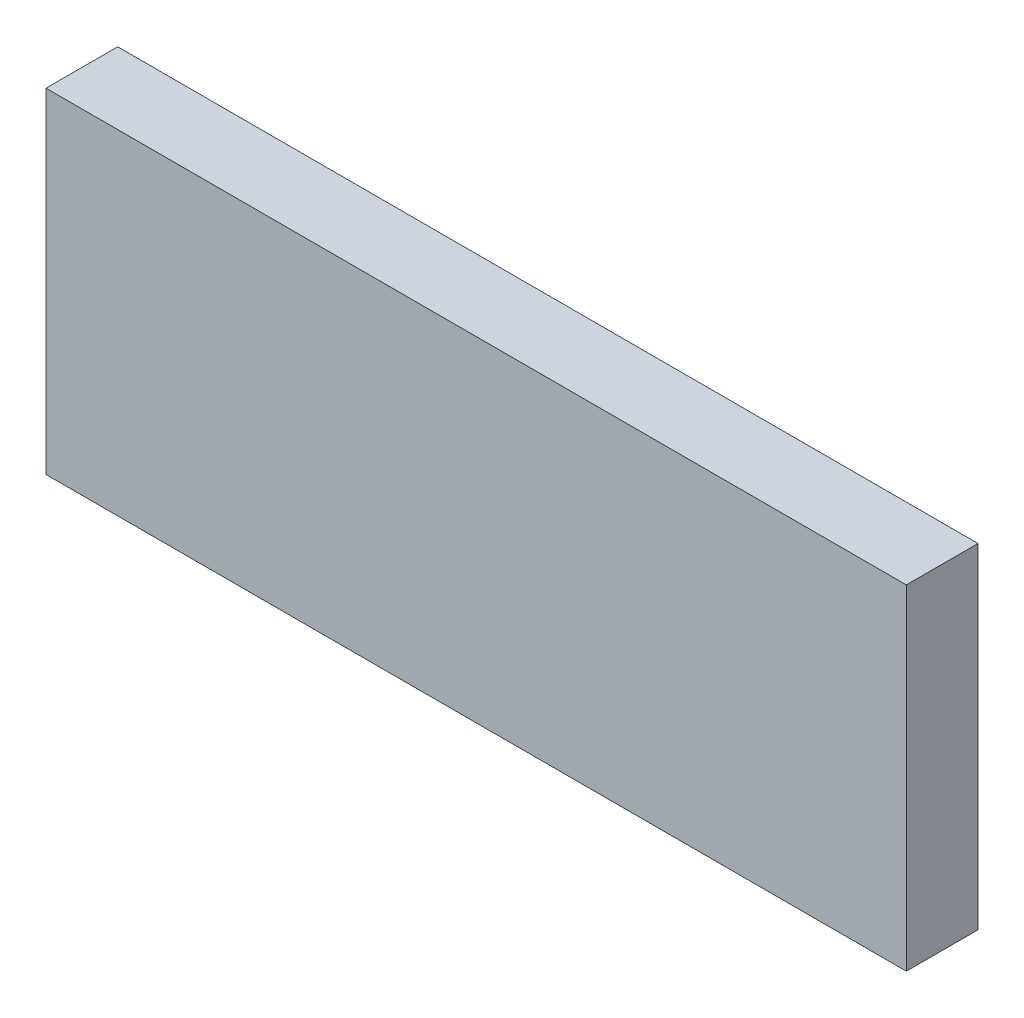
ISO-10303-21;
HEADER;
FILE_DESCRIPTION(('STEP AP214'),'2;1');
FILE_NAME('part.step','',(''),(''),'','','');
FILE_SCHEMA(('AUTOMOTIVE_DESIGN { 1 0 10303 214 1 1 1 1 }'));
ENDSEC;
DATA;
#1=APPLICATION_CONTEXT('core data for automotive mechanical design processes');
#2=APPLICATION_PROTOCOL_DEFINITION('international standard','automotive_design',2000,#1);
#3=PRODUCT_CONTEXT('',#1,'mechanical');
#4=PRODUCT('Part','Part','',(#3));
#5=PRODUCT_RELATED_PRODUCT_CATEGORY('part','',(#4));
#6=PRODUCT_DEFINITION_FORMATION('','',#4);
#7=PRODUCT_DEFINITION_CONTEXT('part definition',#1,'design');
#8=PRODUCT_DEFINITION('design','',#6,#7);
#9=PRODUCT_DEFINITION_SHAPE('','',#8);
#10=(LENGTH_UNIT() NAMED_UNIT(*) SI_UNIT(.MILLI.,.METRE.));
#11=(NAMED_UNIT(*) PLANE_ANGLE_UNIT() SI_UNIT($,.RADIAN.));
#12=(NAMED_UNIT(*) SI_UNIT($,.STERADIAN.) SOLID_ANGLE_UNIT());
#13=UNCERTAINTY_MEASURE_WITH_UNIT(LENGTH_MEASURE(1.E-05),#10,'distance_accuracy_value','');
#14=(GEOMETRIC_REPRESENTATION_CONTEXT(3) GLOBAL_UNCERTAINTY_ASSIGNED_CONTEXT((#13)) GLOBAL_UNIT_ASSIGNED_CONTEXT((#10,
#11,#12)) REPRESENTATION_CONTEXT('',''));
#15=CARTESIAN_POINT('',(0.,0.,0.));
#16=DIRECTION('',(0.,0.,1.));
#17=DIRECTION('',(1.,0.,0.));
#18=AXIS2_PLACEMENT_3D('',#15,#16,#17);
#19=CARTESIAN_POINT('',(0.,0.,0.15));
#20=DIRECTION('',(0.,0.,1.));
#21=DIRECTION('',(1.,0.,0.));
#22=AXIS2_PLACEMENT_3D('',#19,#20,#21);
#23=PLANE('',#22);
#24=DIRECTION('',(0.,1.,0.));
#25=VECTOR('',#24,1.);
#26=CARTESIAN_POINT('',(-1.95,1.15,0.15));
#27=LINE('',#26,#25);
#28=CARTESIAN_POINT('',(-1.95,1.15,0.15));
#29=VERTEX_POINT('',#28);
#30=CARTESIAN_POINT('',(-1.95,1.85,0.15));
#31=VERTEX_POINT('',#30);
#32=EDGE_CURVE('E54',#29,#31,#27,.T.);
#33=ORIENTED_EDGE('',*,*,#32,.T.);
#34=DIRECTION('',(1.,0.,0.));
#35=VECTOR('',#34,1.);
#36=CARTESIAN_POINT('',(-1.95,1.85,0.15));
#37=LINE('',#36,#35);
#38=CARTESIAN_POINT('',(-3.75,1.85,0.15));
#39=VERTEX_POINT('',#38);
#40=EDGE_CURVE('E76',#31,#39,#37,.F.);
#41=ORIENTED_EDGE('',*,*,#40,.T.);
#42=DIRECTION('',(0.,1.,0.));
#43=VECTOR('',#42,1.);
#44=CARTESIAN_POINT('',(-3.75,0.,0.15));
#45=LINE('',#44,#43);
#46=CARTESIAN_POINT('',(-3.75,1.15,0.15));
#47=VERTEX_POINT('',#46);
#48=EDGE_CURVE('E19',#39,#47,#45,.F.);
#49=ORIENTED_EDGE('',*,*,#48,.T.);
#50=DIRECTION('',(-1.,0.,0.));
#51=VECTOR('',#50,1.);
#52=CARTESIAN_POINT('',(-3.75,1.15,0.15));
#53=LINE('',#52,#51);
#54=EDGE_CURVE('E57',#47,#29,#53,.F.);
#55=ORIENTED_EDGE('',*,*,#54,.T.);
#56=EDGE_LOOP('',(#33,#41,#49,#55));
#57=FACE_BOUND('',#56,.T.);
#58=ADVANCED_FACE('F16',(#57),#23,.T.);
#59=CARTESIAN_POINT('',(-3.75,1.15,0.15));
#60=DIRECTION('',(0.,1.,0.));
#61=DIRECTION('',(-1.,0.,0.));
#62=AXIS2_PLACEMENT_3D('',#59,#60,#61);
#63=PLANE('',#62);
#64=DIRECTION('',(0.,0.,1.));
#65=VECTOR('',#64,1.);
#66=CARTESIAN_POINT('',(-1.95,1.15,0.15));
#67=LINE('',#66,#65);
#68=CARTESIAN_POINT('',(-1.95,1.15,0.));
#69=VERTEX_POINT('',#68);
#70=EDGE_CURVE('E62',#69,#29,#67,.T.);
#71=ORIENTED_EDGE('',*,*,#70,.T.);
#72=ORIENTED_EDGE('',*,*,#54,.F.);
#73=DIRECTION('',(0.,0.,1.));
#74=VECTOR('',#73,1.);
#75=CARTESIAN_POINT('',(-3.75,1.15,0.15));
#76=LINE('',#75,#74);
#77=CARTESIAN_POINT('',(-3.75,1.15,0.));
#78=VERTEX_POINT('',#77);
#79=EDGE_CURVE('E79',#47,#78,#76,.F.);
#80=ORIENTED_EDGE('',*,*,#79,.T.);
#81=DIRECTION('',(1.,0.,0.));
#82=VECTOR('',#81,1.);
#83=CARTESIAN_POINT('',(0.,1.15,0.));
#84=LINE('',#83,#82);
#85=EDGE_CURVE('E72',#78,#69,#84,.T.);
#86=ORIENTED_EDGE('',*,*,#85,.T.);
#87=EDGE_LOOP('',(#71,#72,#80,#86));
#88=FACE_BOUND('',#87,.T.);
#89=ADVANCED_FACE('F71',(#88),#63,.F.);
#90=CARTESIAN_POINT('',(-1.95,1.15,0.15));
#91=DIRECTION('',(-1.,0.,0.));
#92=DIRECTION('',(0.,0.,1.));
#93=AXIS2_PLACEMENT_3D('',#90,#91,#92);
#94=PLANE('',#93);
#95=DIRECTION('',(0.,0.,-1.));
#96=VECTOR('',#95,1.);
#97=CARTESIAN_POINT('',(-1.95,1.85,0.15));
#98=LINE('',#97,#96);
#99=CARTESIAN_POINT('',(-1.95,1.85,0.));
#100=VERTEX_POINT('',#99);
#101=EDGE_CURVE('E68',#100,#31,#98,.F.);
#102=ORIENTED_EDGE('',*,*,#101,.T.);
#103=ORIENTED_EDGE('',*,*,#32,.F.);
#104=ORIENTED_EDGE('',*,*,#70,.F.);
#105=DIRECTION('',(0.,1.,0.));
#106=VECTOR('',#105,1.);
#107=CARTESIAN_POINT('',(-1.95,0.,0.));
#108=LINE('',#107,#106);
#109=EDGE_CURVE('E82',#69,#100,#108,.T.);
#110=ORIENTED_EDGE('',*,*,#109,.T.);
#111=EDGE_LOOP('',(#102,#103,#104,#110));
#112=FACE_BOUND('',#111,.T.);
#113=ADVANCED_FACE('F65',(#112),#94,.F.);
#114=CARTESIAN_POINT('',(-1.95,1.85,0.15));
#115=DIRECTION('',(0.,-1.,0.));
#116=DIRECTION('',(0.,0.,-1.));
#117=AXIS2_PLACEMENT_3D('',#114,#115,#116);
#118=PLANE('',#117);
#119=DIRECTION('',(0.,0.,1.));
#120=VECTOR('',#119,1.);
#121=CARTESIAN_POINT('',(-3.75,1.85,0.15));
#122=LINE('',#121,#120);
#123=CARTESIAN_POINT('',(-3.75,1.85,0.));
#124=VERTEX_POINT('',#123);
#125=EDGE_CURVE('E33',#124,#39,#122,.T.);
#126=ORIENTED_EDGE('',*,*,#125,.T.);
#127=ORIENTED_EDGE('',*,*,#40,.F.);
#128=ORIENTED_EDGE('',*,*,#101,.F.);
#129=DIRECTION('',(1.,0.,0.));
#130=VECTOR('',#129,1.);
#131=CARTESIAN_POINT('',(0.,1.85,0.));
#132=LINE('',#131,#130);
#133=EDGE_CURVE('E25',#100,#124,#132,.F.);
#134=ORIENTED_EDGE('',*,*,#133,.T.);
#135=EDGE_LOOP('',(#126,#127,#128,#134));
#136=FACE_BOUND('',#135,.T.);
#137=ADVANCED_FACE('F87',(#136),#118,.F.);
#138=CARTESIAN_POINT('',(-3.75,1.85,0.15));
#139=DIRECTION('',(1.,0.,0.));
#140=DIRECTION('',(0.,1.,0.));
#141=AXIS2_PLACEMENT_3D('',#138,#139,#140);
#142=PLANE('',#141);
#143=ORIENTED_EDGE('',*,*,#79,.F.);
#144=ORIENTED_EDGE('',*,*,#48,.F.);
#145=ORIENTED_EDGE('',*,*,#125,.F.);
#146=DIRECTION('',(0.,1.,0.));
#147=VECTOR('',#146,1.);
#148=CARTESIAN_POINT('',(-3.75,0.,0.));
#149=LINE('',#148,#147);
#150=EDGE_CURVE('E11',#124,#78,#149,.F.);
#151=ORIENTED_EDGE('',*,*,#150,.T.);
#152=EDGE_LOOP('',(#143,#144,#145,#151));
#153=FACE_BOUND('',#152,.T.);
#154=ADVANCED_FACE('F90',(#153),#142,.F.);
#155=CARTESIAN_POINT('',(0.,0.,0.));
#156=DIRECTION('',(0.,0.,1.));
#157=DIRECTION('',(1.,0.,0.));
#158=AXIS2_PLACEMENT_3D('',#155,#156,#157);
#159=PLANE('',#158);
#160=ORIENTED_EDGE('',*,*,#133,.F.);
#161=ORIENTED_EDGE('',*,*,#109,.F.);
#162=ORIENTED_EDGE('',*,*,#85,.F.);
#163=ORIENTED_EDGE('',*,*,#150,.F.);
#164=EDGE_LOOP('',(#160,#161,#162,#163));
#165=FACE_BOUND('',#164,.T.);
#166=ADVANCED_FACE('F89',(#165),#159,.F.);
#167=CLOSED_SHELL('',(#58,#89,#113,#137,#154,#166));
#168=MANIFOLD_SOLID_BREP('B1',#167);
#169=ADVANCED_BREP_SHAPE_REPRESENTATION('',(#18,#168),#14);
#170=SHAPE_DEFINITION_REPRESENTATION(#9,#169);
ENDSEC;
END-ISO-10303-21;
